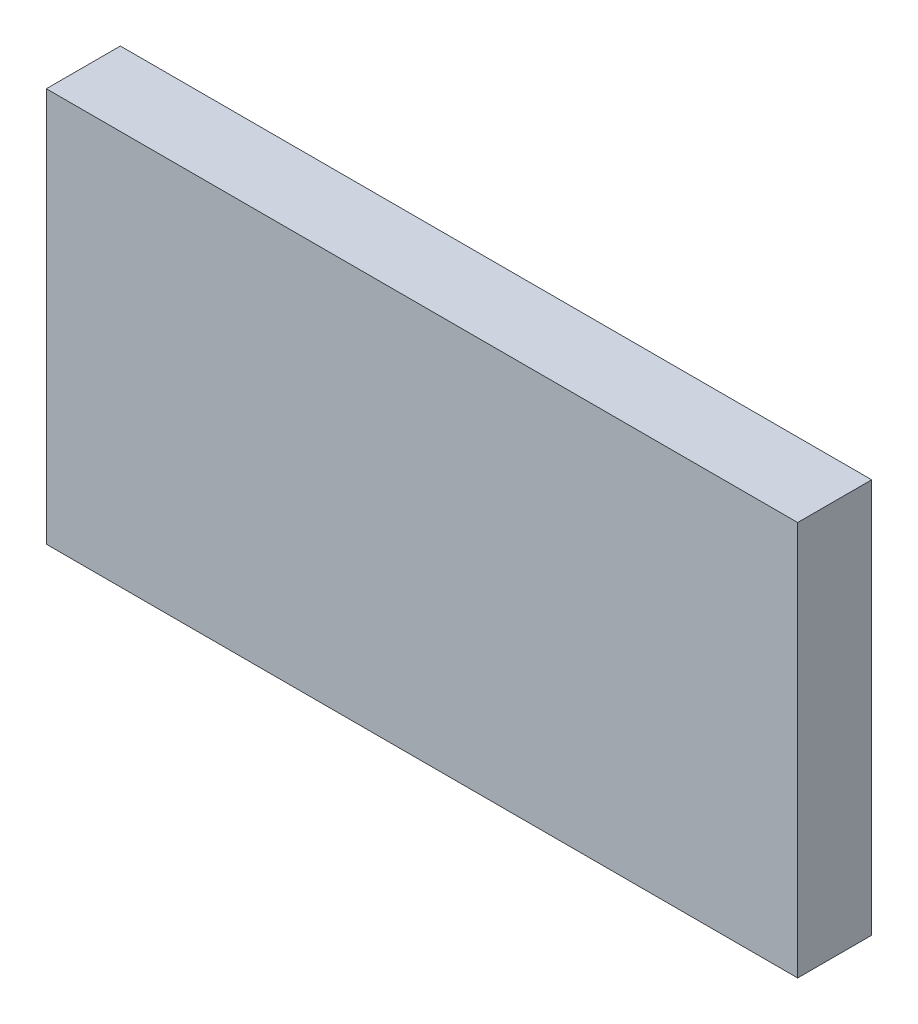
ISO-10303-21;
HEADER;
FILE_DESCRIPTION(('STEP AP214'),'2;1');
FILE_NAME('part.step','',(''),(''),'','','');
FILE_SCHEMA(('AUTOMOTIVE_DESIGN { 1 0 10303 214 1 1 1 1 }'));
ENDSEC;
DATA;
#1=APPLICATION_CONTEXT('core data for automotive mechanical design processes');
#2=APPLICATION_PROTOCOL_DEFINITION('international standard','automotive_design',2000,#1);
#3=PRODUCT_CONTEXT('',#1,'mechanical');
#4=PRODUCT('Part','Part','',(#3));
#5=PRODUCT_RELATED_PRODUCT_CATEGORY('part','',(#4));
#6=PRODUCT_DEFINITION_FORMATION('','',#4);
#7=PRODUCT_DEFINITION_CONTEXT('part definition',#1,'design');
#8=PRODUCT_DEFINITION('design','',#6,#7);
#9=PRODUCT_DEFINITION_SHAPE('','',#8);
#10=(LENGTH_UNIT() NAMED_UNIT(*) SI_UNIT(.MILLI.,.METRE.));
#11=(NAMED_UNIT(*) PLANE_ANGLE_UNIT() SI_UNIT($,.RADIAN.));
#12=(NAMED_UNIT(*) SI_UNIT($,.STERADIAN.) SOLID_ANGLE_UNIT());
#13=UNCERTAINTY_MEASURE_WITH_UNIT(LENGTH_MEASURE(1.E-05),#10,'distance_accuracy_value','');
#14=(GEOMETRIC_REPRESENTATION_CONTEXT(3) GLOBAL_UNCERTAINTY_ASSIGNED_CONTEXT((#13)) GLOBAL_UNIT_ASSIGNED_CONTEXT((#10,
#11,#12)) REPRESENTATION_CONTEXT('',''));
#15=CARTESIAN_POINT('',(0.,0.,0.));
#16=DIRECTION('',(0.,0.,1.));
#17=DIRECTION('',(1.,0.,0.));
#18=AXIS2_PLACEMENT_3D('',#15,#16,#17);
#19=CARTESIAN_POINT('',(-50.76,26.65,10.));
#20=DIRECTION('',(1.,0.,0.));
#21=DIRECTION('',(0.,0.,-1.));
#22=AXIS2_PLACEMENT_3D('',#19,#20,#21);
#23=PLANE('',#22);
#24=DIRECTION('',(0.,-1.,0.));
#25=VECTOR('',#24,1.);
#26=CARTESIAN_POINT('',(-50.76,26.65,0.));
#27=LINE('',#26,#25);
#28=CARTESIAN_POINT('',(-50.76,26.65,0.));
#29=VERTEX_POINT('',#28);
#30=CARTESIAN_POINT('',(-50.76,-26.65,0.));
#31=VERTEX_POINT('',#30);
#32=EDGE_CURVE('E96',#29,#31,#27,.T.);
#33=ORIENTED_EDGE('',*,*,#32,.T.);
#34=DIRECTION('',(0.,0.,-1.));
#35=VECTOR('',#34,1.);
#36=CARTESIAN_POINT('',(-50.76,-26.65,10.));
#37=LINE('',#36,#35);
#38=CARTESIAN_POINT('',(-50.76,-26.65,10.));
#39=VERTEX_POINT('',#38);
#40=EDGE_CURVE('E11',#39,#31,#37,.T.);
#41=ORIENTED_EDGE('',*,*,#40,.F.);
#42=DIRECTION('',(0.,-1.,0.));
#43=VECTOR('',#42,1.);
#44=CARTESIAN_POINT('',(-50.76,26.65,10.));
#45=LINE('',#44,#43);
#46=CARTESIAN_POINT('',(-50.76,26.65,10.));
#47=VERTEX_POINT('',#46);
#48=EDGE_CURVE('E84',#47,#39,#45,.T.);
#49=ORIENTED_EDGE('',*,*,#48,.F.);
#50=DIRECTION('',(0.,0.,-1.));
#51=VECTOR('',#50,1.);
#52=CARTESIAN_POINT('',(-50.76,26.65,10.));
#53=LINE('',#52,#51);
#54=EDGE_CURVE('E92',#47,#29,#53,.T.);
#55=ORIENTED_EDGE('',*,*,#54,.T.);
#56=EDGE_LOOP('',(#33,#41,#49,#55));
#57=FACE_BOUND('',#56,.T.);
#58=ADVANCED_FACE('F33',(#57),#23,.F.);
#59=CARTESIAN_POINT('',(-50.76,-26.65,10.));
#60=DIRECTION('',(0.,1.,0.));
#61=DIRECTION('',(-1.,0.,0.));
#62=AXIS2_PLACEMENT_3D('',#59,#60,#61);
#63=PLANE('',#62);
#64=DIRECTION('',(1.,0.,0.));
#65=VECTOR('',#64,1.);
#66=CARTESIAN_POINT('',(-50.76,-26.65,0.));
#67=LINE('',#66,#65);
#68=CARTESIAN_POINT('',(50.76,-26.65,0.));
#69=VERTEX_POINT('',#68);
#70=EDGE_CURVE('E88',#31,#69,#67,.T.);
#71=ORIENTED_EDGE('',*,*,#70,.T.);
#72=DIRECTION('',(0.,0.,-1.));
#73=VECTOR('',#72,1.);
#74=CARTESIAN_POINT('',(50.76,-26.65,10.));
#75=LINE('',#74,#73);
#76=CARTESIAN_POINT('',(50.76,-26.65,10.));
#77=VERTEX_POINT('',#76);
#78=EDGE_CURVE('E41',#77,#69,#75,.T.);
#79=ORIENTED_EDGE('',*,*,#78,.F.);
#80=DIRECTION('',(1.,0.,0.));
#81=VECTOR('',#80,1.);
#82=CARTESIAN_POINT('',(-50.76,-26.65,10.));
#83=LINE('',#82,#81);
#84=EDGE_CURVE('E79',#39,#77,#83,.T.);
#85=ORIENTED_EDGE('',*,*,#84,.F.);
#86=ORIENTED_EDGE('',*,*,#40,.T.);
#87=EDGE_LOOP('',(#71,#79,#85,#86));
#88=FACE_BOUND('',#87,.T.);
#89=ADVANCED_FACE('F87',(#88),#63,.F.);
#90=CARTESIAN_POINT('',(50.76,26.65,10.));
#91=DIRECTION('',(-1.,0.,0.));
#92=DIRECTION('',(0.,0.,1.));
#93=AXIS2_PLACEMENT_3D('',#90,#91,#92);
#94=PLANE('',#93);
#95=DIRECTION('',(0.,1.,0.));
#96=VECTOR('',#95,1.);
#97=CARTESIAN_POINT('',(50.76,26.65,0.));
#98=LINE('',#97,#96);
#99=CARTESIAN_POINT('',(50.76,26.65,0.));
#100=VERTEX_POINT('',#99);
#101=EDGE_CURVE('E66',#69,#100,#98,.T.);
#102=ORIENTED_EDGE('',*,*,#101,.T.);
#103=DIRECTION('',(0.,0.,-1.));
#104=VECTOR('',#103,1.);
#105=CARTESIAN_POINT('',(50.76,26.65,10.));
#106=LINE('',#105,#104);
#107=CARTESIAN_POINT('',(50.76,26.65,10.));
#108=VERTEX_POINT('',#107);
#109=EDGE_CURVE('E89',#108,#100,#106,.T.);
#110=ORIENTED_EDGE('',*,*,#109,.F.);
#111=DIRECTION('',(0.,1.,0.));
#112=VECTOR('',#111,1.);
#113=CARTESIAN_POINT('',(50.76,26.65,10.));
#114=LINE('',#113,#112);
#115=EDGE_CURVE('E82',#77,#108,#114,.T.);
#116=ORIENTED_EDGE('',*,*,#115,.F.);
#117=ORIENTED_EDGE('',*,*,#78,.T.);
#118=EDGE_LOOP('',(#102,#110,#116,#117));
#119=FACE_BOUND('',#118,.T.);
#120=ADVANCED_FACE('F90',(#119),#94,.F.);
#121=CARTESIAN_POINT('',(-50.76,26.65,10.));
#122=DIRECTION('',(0.,-1.,0.));
#123=DIRECTION('',(0.,0.,-1.));
#124=AXIS2_PLACEMENT_3D('',#121,#122,#123);
#125=PLANE('',#124);
#126=DIRECTION('',(-1.,0.,0.));
#127=VECTOR('',#126,1.);
#128=CARTESIAN_POINT('',(-50.76,26.65,0.));
#129=LINE('',#128,#127);
#130=EDGE_CURVE('E72',#100,#29,#129,.T.);
#131=ORIENTED_EDGE('',*,*,#130,.T.);
#132=ORIENTED_EDGE('',*,*,#54,.F.);
#133=DIRECTION('',(-1.,0.,0.));
#134=VECTOR('',#133,1.);
#135=CARTESIAN_POINT('',(-50.76,26.65,10.));
#136=LINE('',#135,#134);
#137=EDGE_CURVE('E49',#108,#47,#136,.T.);
#138=ORIENTED_EDGE('',*,*,#137,.F.);
#139=ORIENTED_EDGE('',*,*,#109,.T.);
#140=EDGE_LOOP('',(#131,#132,#138,#139));
#141=FACE_BOUND('',#140,.T.);
#142=ADVANCED_FACE('F103',(#141),#125,.F.);
#143=CARTESIAN_POINT('',(0.,0.,10.));
#144=DIRECTION('',(0.,0.,1.));
#145=DIRECTION('',(1.,0.,0.));
#146=AXIS2_PLACEMENT_3D('',#143,#144,#145);
#147=PLANE('',#146);
#148=ORIENTED_EDGE('',*,*,#48,.T.);
#149=ORIENTED_EDGE('',*,*,#84,.T.);
#150=ORIENTED_EDGE('',*,*,#115,.T.);
#151=ORIENTED_EDGE('',*,*,#137,.T.);
#152=EDGE_LOOP('',(#148,#149,#150,#151));
#153=FACE_BOUND('',#152,.T.);
#154=ADVANCED_FACE('F80',(#153),#147,.T.);
#155=CARTESIAN_POINT('',(0.,0.,0.));
#156=DIRECTION('',(0.,0.,1.));
#157=DIRECTION('',(1.,0.,0.));
#158=AXIS2_PLACEMENT_3D('',#155,#156,#157);
#159=PLANE('',#158);
#160=ORIENTED_EDGE('',*,*,#32,.F.);
#161=ORIENTED_EDGE('',*,*,#130,.F.);
#162=ORIENTED_EDGE('',*,*,#101,.F.);
#163=ORIENTED_EDGE('',*,*,#70,.F.);
#164=EDGE_LOOP('',(#160,#161,#162,#163));
#165=FACE_BOUND('',#164,.T.);
#166=ADVANCED_FACE('F106',(#165),#159,.F.);
#167=CLOSED_SHELL('',(#58,#89,#120,#142,#154,#166));
#168=MANIFOLD_SOLID_BREP('B2',#167);
#169=ADVANCED_BREP_SHAPE_REPRESENTATION('',(#18,#168),#14);
#170=SHAPE_DEFINITION_REPRESENTATION(#9,#169);
ENDSEC;
END-ISO-10303-21;
